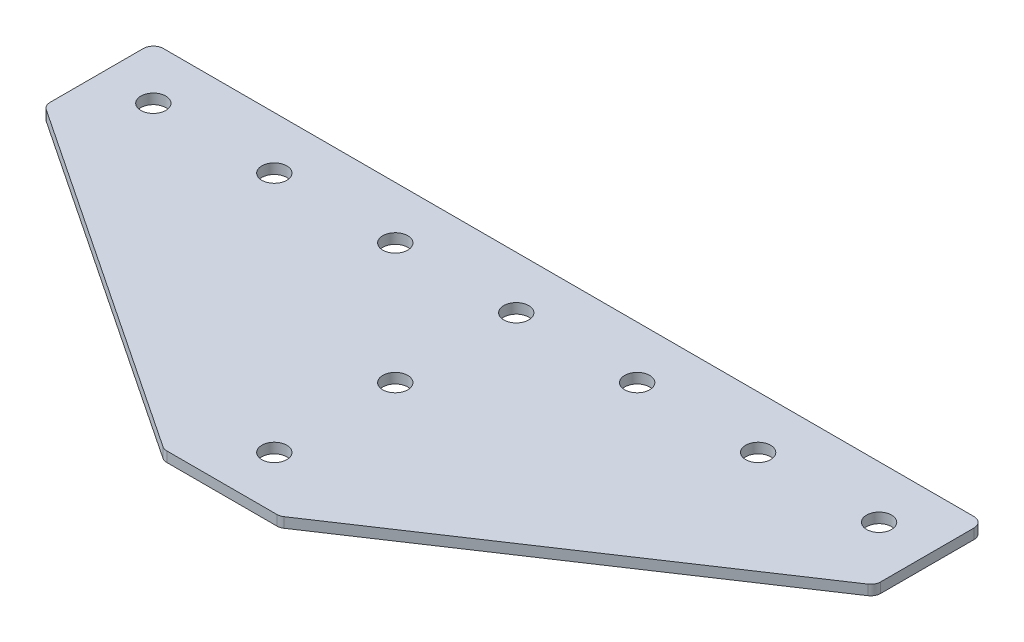
ISO-10303-21;
HEADER;
FILE_DESCRIPTION(('STEP AP214'),'2;1');
FILE_NAME('part.step','',(''),(''),'','','');
FILE_SCHEMA(('AUTOMOTIVE_DESIGN { 1 0 10303 214 1 1 1 1 }'));
ENDSEC;
DATA;
#1=APPLICATION_CONTEXT('core data for automotive mechanical design processes');
#2=APPLICATION_PROTOCOL_DEFINITION('international standard','automotive_design',2000,#1);
#3=PRODUCT_CONTEXT('',#1,'mechanical');
#4=PRODUCT('Part','Part','',(#3));
#5=PRODUCT_RELATED_PRODUCT_CATEGORY('part','',(#4));
#6=PRODUCT_DEFINITION_FORMATION('','',#4);
#7=PRODUCT_DEFINITION_CONTEXT('part definition',#1,'design');
#8=PRODUCT_DEFINITION('design','',#6,#7);
#9=PRODUCT_DEFINITION_SHAPE('','',#8);
#10=(LENGTH_UNIT() NAMED_UNIT(*) SI_UNIT(.MILLI.,.METRE.));
#11=(NAMED_UNIT(*) PLANE_ANGLE_UNIT() SI_UNIT($,.RADIAN.));
#12=(NAMED_UNIT(*) SI_UNIT($,.STERADIAN.) SOLID_ANGLE_UNIT());
#13=UNCERTAINTY_MEASURE_WITH_UNIT(LENGTH_MEASURE(1.E-05),#10,'distance_accuracy_value','');
#14=(GEOMETRIC_REPRESENTATION_CONTEXT(3) GLOBAL_UNCERTAINTY_ASSIGNED_CONTEXT((#13)) GLOBAL_UNIT_ASSIGNED_CONTEXT((#10,
#11,#12)) REPRESENTATION_CONTEXT('',''));
#15=CARTESIAN_POINT('',(0.,0.,0.));
#16=DIRECTION('',(0.,0.,1.));
#17=DIRECTION('',(1.,0.,0.));
#18=AXIS2_PLACEMENT_3D('',#15,#16,#17);
#19=CARTESIAN_POINT('',(-2.23293059684693,1.89126526075142,-30.907824161743));
#20=DIRECTION('',(0.,-1.,0.));
#21=DIRECTION('',(0.,0.,-1.));
#22=AXIS2_PLACEMENT_3D('',#19,#20,#21);
#23=PLANE('',#22);
#24=CARTESIAN_POINT('',(-2.23293059684693,1.89126526075142,-30.907824161743));
#25=DIRECTION('',(0.,1.,0.));
#26=DIRECTION('',(0.,0.,1.));
#27=AXIS2_PLACEMENT_3D('',#24,#25,#26);
#28=CIRCLE('',#27,3.1);
#29=CARTESIAN_POINT('',(-2.23293059684693,1.89126526075142,-27.807824161743));
#30=VERTEX_POINT('',#29);
#31=EDGE_CURVE('E119',#30,#30,#28,.T.);
#32=ORIENTED_EDGE('',*,*,#31,.T.);
#33=EDGE_LOOP('',(#32));
#34=FACE_BOUND('',#33,.T.);
#35=DIRECTION('',(1.,0.,0.));
#36=VECTOR('',#35,1.);
#37=CARTESIAN_POINT('',(-15.232930596847,1.89126526075142,42.0921758382569));
#38=LINE('',#37,#36);
#39=CARTESIAN_POINT('',(-15.870440227053,1.89126526075142,42.0921758382569));
#40=VERTEX_POINT('',#39);
#41=CARTESIAN_POINT('',(11.4045790333592,1.89126526075142,42.0921758382569));
#42=VERTEX_POINT('',#41);
#43=EDGE_CURVE('E176',#40,#42,#38,.T.);
#44=ORIENTED_EDGE('',*,*,#43,.F.);
#45=CARTESIAN_POINT('',(-15.870440227053,1.89126526075142,39.5921758382569));
#46=DIRECTION('',(0.,1.,0.));
#47=DIRECTION('',(0.,0.,-1.));
#48=AXIS2_PLACEMENT_3D('',#45,#46,#47);
#49=CIRCLE('',#48,2.5);
#50=CARTESIAN_POINT('',(-17.2571907176161,1.89126526075142,41.6723015741015));
#51=VERTEX_POINT('',#50);
#52=EDGE_CURVE('E233',#51,#40,#49,.T.);
#53=ORIENTED_EDGE('',*,*,#52,.F.);
#54=DIRECTION('',(-0.832050294337843,0.,-0.554700196225229));
#55=VECTOR('',#54,1.);
#56=CARTESIAN_POINT('',(-16.627379321383,1.89126526075142,42.0921758382569));
#57=LINE('',#56,#55);
#58=CARTESIAN_POINT('',(-104.11968108741,1.89126526075142,-16.2360253390943));
#59=VERTEX_POINT('',#58);
#60=EDGE_CURVE('E236',#51,#59,#57,.T.);
#61=ORIENTED_EDGE('',*,*,#60,.T.);
#62=CARTESIAN_POINT('',(-102.732930596847,1.89126526075142,-18.3161510749389));
#63=DIRECTION('',(0.,1.,0.));
#64=DIRECTION('',(0.,0.,-1.));
#65=AXIS2_PLACEMENT_3D('',#62,#63,#64);
#66=CIRCLE('',#65,2.5);
#67=CARTESIAN_POINT('',(-105.232930596847,1.89126526075142,-18.3161510749389));
#68=VERTEX_POINT('',#67);
#69=EDGE_CURVE('E239',#68,#59,#66,.T.);
#70=ORIENTED_EDGE('',*,*,#69,.F.);
#71=DIRECTION('',(0.,0.,-1.));
#72=VECTOR('',#71,1.);
#73=CARTESIAN_POINT('',(-105.232930596847,1.89126526075142,-16.978191678719));
#74=LINE('',#73,#72);
#75=CARTESIAN_POINT('',(-105.232930596847,1.89126526075142,-41.407824161743));
#76=VERTEX_POINT('',#75);
#77=EDGE_CURVE('E130',#68,#76,#74,.T.);
#78=ORIENTED_EDGE('',*,*,#77,.T.);
#79=CARTESIAN_POINT('',(-102.732930596847,1.89126526075142,-41.407824161743));
#80=DIRECTION('',(0.,1.,0.));
#81=DIRECTION('',(0.,0.,-1.));
#82=AXIS2_PLACEMENT_3D('',#79,#80,#81);
#83=CIRCLE('',#82,2.5);
#84=CARTESIAN_POINT('',(-102.732930596847,1.89126526075142,-43.907824161743));
#85=VERTEX_POINT('',#84);
#86=EDGE_CURVE('E245',#85,#76,#83,.T.);
#87=ORIENTED_EDGE('',*,*,#86,.F.);
#88=DIRECTION('',(-1.,0.,0.));
#89=VECTOR('',#88,1.);
#90=CARTESIAN_POINT('',(100.767069403153,1.89126526075142,-43.9078241617431));
#91=LINE('',#90,#89);
#92=CARTESIAN_POINT('',(98.267069403153,1.89126526075142,-43.9078241617431));
#93=VERTEX_POINT('',#92);
#94=EDGE_CURVE('E134',#93,#85,#91,.T.);
#95=ORIENTED_EDGE('',*,*,#94,.F.);
#96=CARTESIAN_POINT('',(98.267069403153,1.89126526075142,-41.4078241617431));
#97=DIRECTION('',(0.,-1.,0.));
#98=DIRECTION('',(0.,0.,-1.));
#99=AXIS2_PLACEMENT_3D('',#96,#97,#98);
#100=CIRCLE('',#99,2.5);
#101=CARTESIAN_POINT('',(100.767069403153,1.89126526075142,-41.4078241617431));
#102=VERTEX_POINT('',#101);
#103=EDGE_CURVE('E197',#93,#102,#100,.T.);
#104=ORIENTED_EDGE('',*,*,#103,.T.);
#105=DIRECTION('',(0.,0.,-1.));
#106=VECTOR('',#105,1.);
#107=CARTESIAN_POINT('',(100.767069403153,1.89126526075142,-16.978191678719));
#108=LINE('',#107,#106);
#109=CARTESIAN_POINT('',(100.767069403153,1.89126526075142,-18.316151074939));
#110=VERTEX_POINT('',#109);
#111=EDGE_CURVE('E181',#110,#102,#108,.T.);
#112=ORIENTED_EDGE('',*,*,#111,.F.);
#113=CARTESIAN_POINT('',(98.267069403153,1.89126526075142,-18.316151074939));
#114=DIRECTION('',(0.,-1.,0.));
#115=DIRECTION('',(0.,0.,-1.));
#116=AXIS2_PLACEMENT_3D('',#113,#114,#115);
#117=CIRCLE('',#116,2.5);
#118=CARTESIAN_POINT('',(99.653819893716,1.89126526075142,-16.2360253390943));
#119=VERTEX_POINT('',#118);
#120=EDGE_CURVE('E31',#110,#119,#117,.T.);
#121=ORIENTED_EDGE('',*,*,#120,.T.);
#122=DIRECTION('',(0.832050294337843,0.,-0.554700196225229));
#123=VECTOR('',#122,1.);
#124=CARTESIAN_POINT('',(12.1615181276892,1.89126526075142,42.0921758382569));
#125=LINE('',#124,#123);
#126=CARTESIAN_POINT('',(12.7913295239223,1.89126526075142,41.6723015741015));
#127=VERTEX_POINT('',#126);
#128=EDGE_CURVE('E179',#127,#119,#125,.T.);
#129=ORIENTED_EDGE('',*,*,#128,.F.);
#130=CARTESIAN_POINT('',(11.4045790333592,1.89126526075142,39.5921758382569));
#131=DIRECTION('',(0.,-1.,0.));
#132=DIRECTION('',(0.,0.,-1.));
#133=AXIS2_PLACEMENT_3D('',#130,#131,#132);
#134=CIRCLE('',#133,2.5);
#135=EDGE_CURVE('E200',#127,#42,#134,.T.);
#136=ORIENTED_EDGE('',*,*,#135,.T.);
#137=EDGE_LOOP('',(#44,#53,#61,#70,#78,#87,#95,#104,#112,#121,#129,#136));
#138=FACE_BOUND('',#137,.T.);
#139=CARTESIAN_POINT('',(-2.23293059684694,1.89126526075142,29.092175838257));
#140=DIRECTION('',(0.,1.,0.));
#141=DIRECTION('',(0.,0.,1.));
#142=AXIS2_PLACEMENT_3D('',#139,#140,#141);
#143=CIRCLE('',#142,3.1);
#144=CARTESIAN_POINT('',(-2.23293059684694,1.89126526075142,32.192175838257));
#145=VERTEX_POINT('',#144);
#146=EDGE_CURVE('E153',#145,#145,#143,.T.);
#147=ORIENTED_EDGE('',*,*,#146,.T.);
#148=EDGE_LOOP('',(#147));
#149=FACE_BOUND('',#148,.T.);
#150=CARTESIAN_POINT('',(-2.23293059684694,1.89126526075142,-0.90782416174302));
#151=DIRECTION('',(0.,1.,0.));
#152=DIRECTION('',(0.,0.,1.));
#153=AXIS2_PLACEMENT_3D('',#150,#151,#152);
#154=CIRCLE('',#153,3.1);
#155=CARTESIAN_POINT('',(-2.23293059684694,1.89126526075142,2.19217583825698));
#156=VERTEX_POINT('',#155);
#157=EDGE_CURVE('E159',#156,#156,#154,.T.);
#158=ORIENTED_EDGE('',*,*,#157,.T.);
#159=EDGE_LOOP('',(#158));
#160=FACE_BOUND('',#159,.T.);
#161=CARTESIAN_POINT('',(87.7670694031531,1.89126526075142,-30.907824161743));
#162=DIRECTION('',(0.,1.,0.));
#163=DIRECTION('',(0.,0.,1.));
#164=AXIS2_PLACEMENT_3D('',#161,#162,#163);
#165=CIRCLE('',#164,3.1);
#166=CARTESIAN_POINT('',(87.7670694031531,1.89126526075142,-27.807824161743));
#167=VERTEX_POINT('',#166);
#168=EDGE_CURVE('E139',#167,#167,#165,.T.);
#169=ORIENTED_EDGE('',*,*,#168,.T.);
#170=EDGE_LOOP('',(#169));
#171=FACE_BOUND('',#170,.T.);
#172=CARTESIAN_POINT('',(57.7670694031531,1.89126526075142,-30.907824161743));
#173=DIRECTION('',(0.,1.,0.));
#174=DIRECTION('',(0.,0.,1.));
#175=AXIS2_PLACEMENT_3D('',#172,#173,#174);
#176=CIRCLE('',#175,3.1);
#177=CARTESIAN_POINT('',(57.7670694031531,1.89126526075142,-27.807824161743));
#178=VERTEX_POINT('',#177);
#179=EDGE_CURVE('E147',#178,#178,#176,.T.);
#180=ORIENTED_EDGE('',*,*,#179,.T.);
#181=EDGE_LOOP('',(#180));
#182=FACE_BOUND('',#181,.T.);
#183=CARTESIAN_POINT('',(27.7670694031531,1.89126526075142,-30.907824161743));
#184=DIRECTION('',(0.,1.,0.));
#185=DIRECTION('',(0.,0.,1.));
#186=AXIS2_PLACEMENT_3D('',#183,#184,#185);
#187=CIRCLE('',#186,3.1);
#188=CARTESIAN_POINT('',(27.7670694031531,1.89126526075142,-27.807824161743));
#189=VERTEX_POINT('',#188);
#190=EDGE_CURVE('E165',#189,#189,#187,.T.);
#191=ORIENTED_EDGE('',*,*,#190,.T.);
#192=EDGE_LOOP('',(#191));
#193=FACE_BOUND('',#192,.T.);
#194=CARTESIAN_POINT('',(-92.2329305968469,1.89126526075142,-30.907824161743));
#195=DIRECTION('',(0.,-1.,0.));
#196=DIRECTION('',(0.,0.,1.));
#197=AXIS2_PLACEMENT_3D('',#194,#195,#196);
#198=CIRCLE('',#197,3.1);
#199=CARTESIAN_POINT('',(-92.2329305968469,1.89126526075142,-27.807824161743));
#200=VERTEX_POINT('',#199);
#201=EDGE_CURVE('E465',#200,#200,#198,.T.);
#202=ORIENTED_EDGE('',*,*,#201,.F.);
#203=EDGE_LOOP('',(#202));
#204=FACE_BOUND('',#203,.T.);
#205=CARTESIAN_POINT('',(-62.2329305968469,1.89126526075142,-30.907824161743));
#206=DIRECTION('',(0.,-1.,0.));
#207=DIRECTION('',(0.,0.,1.));
#208=AXIS2_PLACEMENT_3D('',#205,#206,#207);
#209=CIRCLE('',#208,3.1);
#210=CARTESIAN_POINT('',(-62.2329305968469,1.89126526075142,-27.807824161743));
#211=VERTEX_POINT('',#210);
#212=EDGE_CURVE('E474',#211,#211,#209,.T.);
#213=ORIENTED_EDGE('',*,*,#212,.F.);
#214=EDGE_LOOP('',(#213));
#215=FACE_BOUND('',#214,.T.);
#216=CARTESIAN_POINT('',(-32.2329305968469,1.89126526075142,-30.907824161743));
#217=DIRECTION('',(0.,-1.,0.));
#218=DIRECTION('',(0.,0.,1.));
#219=AXIS2_PLACEMENT_3D('',#216,#217,#218);
#220=CIRCLE('',#219,3.1);
#221=CARTESIAN_POINT('',(-32.2329305968469,1.89126526075142,-27.807824161743));
#222=VERTEX_POINT('',#221);
#223=EDGE_CURVE('E266',#222,#222,#220,.T.);
#224=ORIENTED_EDGE('',*,*,#223,.F.);
#225=EDGE_LOOP('',(#224));
#226=FACE_BOUND('',#225,.T.);
#227=ADVANCED_FACE('F16',(#34,#138,#149,#160,#171,#182,#193,#204,#215,#226),#23,.T.);
#228=CARTESIAN_POINT('',(100.767069403153,1.89126526075142,-43.9078241617431));
#229=DIRECTION('',(0.,0.,-1.));
#230=DIRECTION('',(-1.,0.,0.));
#231=AXIS2_PLACEMENT_3D('',#228,#229,#230);
#232=PLANE('',#231);
#233=ORIENTED_EDGE('',*,*,#94,.T.);
#234=DIRECTION('',(0.,1.,0.));
#235=VECTOR('',#234,1.);
#236=CARTESIAN_POINT('',(-102.732930596847,1.89126526075142,-43.907824161743));
#237=LINE('',#236,#235);
#238=CARTESIAN_POINT('',(-102.732930596847,4.39126526075142,-43.907824161743));
#239=VERTEX_POINT('',#238);
#240=EDGE_CURVE('E125',#239,#85,#237,.F.);
#241=ORIENTED_EDGE('',*,*,#240,.F.);
#242=DIRECTION('',(-1.,0.,0.));
#243=VECTOR('',#242,1.);
#244=CARTESIAN_POINT('',(100.767069403153,4.39126526075142,-43.9078241617431));
#245=LINE('',#244,#243);
#246=CARTESIAN_POINT('',(98.267069403153,4.39126526075142,-43.9078241617431));
#247=VERTEX_POINT('',#246);
#248=EDGE_CURVE('E105',#247,#239,#245,.T.);
#249=ORIENTED_EDGE('',*,*,#248,.F.);
#250=DIRECTION('',(0.,1.,0.));
#251=VECTOR('',#250,1.);
#252=CARTESIAN_POINT('',(98.267069403153,1.89126526075142,-43.9078241617431));
#253=LINE('',#252,#251);
#254=EDGE_CURVE('E10',#247,#93,#253,.F.);
#255=ORIENTED_EDGE('',*,*,#254,.T.);
#256=EDGE_LOOP('',(#233,#241,#249,#255));
#257=FACE_BOUND('',#256,.T.);
#258=ADVANCED_FACE('F132',(#257),#232,.T.);
#259=CARTESIAN_POINT('',(100.767069403153,1.89126526075142,-16.978191678719));
#260=DIRECTION('',(1.,0.,0.));
#261=DIRECTION('',(0.,0.,-1.));
#262=AXIS2_PLACEMENT_3D('',#259,#260,#261);
#263=PLANE('',#262);
#264=DIRECTION('',(0.,0.,-1.));
#265=VECTOR('',#264,1.);
#266=CARTESIAN_POINT('',(100.767069403153,4.39126526075142,-16.978191678719));
#267=LINE('',#266,#265);
#268=CARTESIAN_POINT('',(100.767069403153,4.39126526075142,-18.316151074939));
#269=VERTEX_POINT('',#268);
#270=CARTESIAN_POINT('',(100.767069403153,4.39126526075142,-41.4078241617431));
#271=VERTEX_POINT('',#270);
#272=EDGE_CURVE('E177',#269,#271,#267,.T.);
#273=ORIENTED_EDGE('',*,*,#272,.F.);
#274=DIRECTION('',(0.,1.,0.));
#275=VECTOR('',#274,1.);
#276=CARTESIAN_POINT('',(100.767069403153,1.89126526075142,-18.316151074939));
#277=LINE('',#276,#275);
#278=EDGE_CURVE('E24',#269,#110,#277,.F.);
#279=ORIENTED_EDGE('',*,*,#278,.T.);
#280=ORIENTED_EDGE('',*,*,#111,.T.);
#281=DIRECTION('',(0.,1.,0.));
#282=VECTOR('',#281,1.);
#283=CARTESIAN_POINT('',(100.767069403153,1.89126526075142,-41.4078241617431));
#284=LINE('',#283,#282);
#285=EDGE_CURVE('E207',#102,#271,#284,.T.);
#286=ORIENTED_EDGE('',*,*,#285,.T.);
#287=EDGE_LOOP('',(#273,#279,#280,#286));
#288=FACE_BOUND('',#287,.T.);
#289=ADVANCED_FACE('F212',(#288),#263,.T.);
#290=CARTESIAN_POINT('',(12.1615181276892,1.89126526075142,42.0921758382569));
#291=DIRECTION('',(0.554700196225229,0.,0.832050294337843));
#292=DIRECTION('',(0.832050294337843,0.,-0.554700196225229));
#293=AXIS2_PLACEMENT_3D('',#290,#291,#292);
#294=PLANE('',#293);
#295=DIRECTION('',(0.832050294337843,0.,-0.554700196225229));
#296=VECTOR('',#295,1.);
#297=CARTESIAN_POINT('',(12.1615181276892,4.39126526075142,42.0921758382569));
#298=LINE('',#297,#296);
#299=CARTESIAN_POINT('',(12.7913295239223,4.39126526075142,41.6723015741015));
#300=VERTEX_POINT('',#299);
#301=CARTESIAN_POINT('',(99.653819893716,4.39126526075142,-16.2360253390943));
#302=VERTEX_POINT('',#301);
#303=EDGE_CURVE('E185',#300,#302,#298,.T.);
#304=ORIENTED_EDGE('',*,*,#303,.F.);
#305=DIRECTION('',(0.,1.,0.));
#306=VECTOR('',#305,1.);
#307=CARTESIAN_POINT('',(12.7913295239223,1.89126526075142,41.6723015741015));
#308=LINE('',#307,#306);
#309=EDGE_CURVE('E38',#300,#127,#308,.F.);
#310=ORIENTED_EDGE('',*,*,#309,.T.);
#311=ORIENTED_EDGE('',*,*,#128,.T.);
#312=DIRECTION('',(0.,1.,0.));
#313=VECTOR('',#312,1.);
#314=CARTESIAN_POINT('',(99.653819893716,1.89126526075142,-16.2360253390943));
#315=LINE('',#314,#313);
#316=EDGE_CURVE('E203',#119,#302,#315,.T.);
#317=ORIENTED_EDGE('',*,*,#316,.T.);
#318=EDGE_LOOP('',(#304,#310,#311,#317));
#319=FACE_BOUND('',#318,.T.);
#320=ADVANCED_FACE('F219',(#319),#294,.T.);
#321=CARTESIAN_POINT('',(-15.232930596847,1.89126526075142,42.0921758382569));
#322=DIRECTION('',(0.,0.,1.));
#323=DIRECTION('',(1.,0.,0.));
#324=AXIS2_PLACEMENT_3D('',#321,#322,#323);
#325=PLANE('',#324);
#326=DIRECTION('',(1.,0.,0.));
#327=VECTOR('',#326,1.);
#328=CARTESIAN_POINT('',(-15.232930596847,4.39126526075142,42.0921758382569));
#329=LINE('',#328,#327);
#330=CARTESIAN_POINT('',(-15.870440227053,4.39126526075142,42.0921758382569));
#331=VERTEX_POINT('',#330);
#332=CARTESIAN_POINT('',(11.4045790333592,4.39126526075142,42.0921758382569));
#333=VERTEX_POINT('',#332);
#334=EDGE_CURVE('E118',#331,#333,#329,.T.);
#335=ORIENTED_EDGE('',*,*,#334,.F.);
#336=DIRECTION('',(0.,1.,0.));
#337=VECTOR('',#336,1.);
#338=CARTESIAN_POINT('',(-15.870440227053,1.89126526075142,42.0921758382569));
#339=LINE('',#338,#337);
#340=EDGE_CURVE('E229',#40,#331,#339,.T.);
#341=ORIENTED_EDGE('',*,*,#340,.F.);
#342=ORIENTED_EDGE('',*,*,#43,.T.);
#343=DIRECTION('',(0.,1.,0.));
#344=VECTOR('',#343,1.);
#345=CARTESIAN_POINT('',(11.4045790333592,1.89126526075142,42.0921758382569));
#346=LINE('',#345,#344);
#347=EDGE_CURVE('E194',#42,#333,#346,.T.);
#348=ORIENTED_EDGE('',*,*,#347,.T.);
#349=EDGE_LOOP('',(#335,#341,#342,#348));
#350=FACE_BOUND('',#349,.T.);
#351=ADVANCED_FACE('F226',(#350),#325,.T.);
#352=CARTESIAN_POINT('',(-2.23293059684693,4.39126526075142,-30.907824161743));
#353=DIRECTION('',(0.,-1.,0.));
#354=DIRECTION('',(0.,0.,-1.));
#355=AXIS2_PLACEMENT_3D('',#352,#353,#354);
#356=PLANE('',#355);
#357=CARTESIAN_POINT('',(-2.23293059684693,4.39126526075142,-30.907824161743));
#358=DIRECTION('',(0.,1.,0.));
#359=DIRECTION('',(0.,0.,1.));
#360=AXIS2_PLACEMENT_3D('',#357,#358,#359);
#361=CIRCLE('',#360,3.1);
#362=CARTESIAN_POINT('',(-2.23293059684693,4.39126526075142,-27.807824161743));
#363=VERTEX_POINT('',#362);
#364=EDGE_CURVE('E168',#363,#363,#361,.T.);
#365=ORIENTED_EDGE('',*,*,#364,.F.);
#366=EDGE_LOOP('',(#365));
#367=FACE_BOUND('',#366,.T.);
#368=CARTESIAN_POINT('',(-15.870440227053,4.39126526075142,39.5921758382569));
#369=DIRECTION('',(0.,1.,0.));
#370=DIRECTION('',(0.,0.,-1.));
#371=AXIS2_PLACEMENT_3D('',#368,#369,#370);
#372=CIRCLE('',#371,2.5);
#373=CARTESIAN_POINT('',(-17.2571907176161,4.39126526075142,41.6723015741015));
#374=VERTEX_POINT('',#373);
#375=EDGE_CURVE('E251',#331,#374,#372,.F.);
#376=ORIENTED_EDGE('',*,*,#375,.F.);
#377=ORIENTED_EDGE('',*,*,#334,.T.);
#378=CARTESIAN_POINT('',(11.4045790333592,4.39126526075142,39.5921758382569));
#379=DIRECTION('',(0.,-1.,0.));
#380=DIRECTION('',(0.,0.,-1.));
#381=AXIS2_PLACEMENT_3D('',#378,#379,#380);
#382=CIRCLE('',#381,2.5);
#383=EDGE_CURVE('E192',#333,#300,#382,.F.);
#384=ORIENTED_EDGE('',*,*,#383,.T.);
#385=ORIENTED_EDGE('',*,*,#303,.T.);
#386=CARTESIAN_POINT('',(98.267069403153,4.39126526075142,-18.316151074939));
#387=DIRECTION('',(0.,-1.,0.));
#388=DIRECTION('',(0.,0.,-1.));
#389=AXIS2_PLACEMENT_3D('',#386,#387,#388);
#390=CIRCLE('',#389,2.5);
#391=EDGE_CURVE('E190',#302,#269,#390,.F.);
#392=ORIENTED_EDGE('',*,*,#391,.T.);
#393=ORIENTED_EDGE('',*,*,#272,.T.);
#394=CARTESIAN_POINT('',(98.267069403153,4.39126526075142,-41.4078241617431));
#395=DIRECTION('',(0.,-1.,0.));
#396=DIRECTION('',(0.,0.,-1.));
#397=AXIS2_PLACEMENT_3D('',#394,#395,#396);
#398=CIRCLE('',#397,2.5);
#399=EDGE_CURVE('E114',#271,#247,#398,.F.);
#400=ORIENTED_EDGE('',*,*,#399,.T.);
#401=ORIENTED_EDGE('',*,*,#248,.T.);
#402=CARTESIAN_POINT('',(-102.732930596847,4.39126526075142,-41.407824161743));
#403=DIRECTION('',(0.,1.,0.));
#404=DIRECTION('',(0.,0.,-1.));
#405=AXIS2_PLACEMENT_3D('',#402,#403,#404);
#406=CIRCLE('',#405,2.5);
#407=CARTESIAN_POINT('',(-105.232930596847,4.39126526075142,-41.407824161743));
#408=VERTEX_POINT('',#407);
#409=EDGE_CURVE('E111',#408,#239,#406,.F.);
#410=ORIENTED_EDGE('',*,*,#409,.F.);
#411=DIRECTION('',(0.,0.,-1.));
#412=VECTOR('',#411,1.);
#413=CARTESIAN_POINT('',(-105.232930596847,4.39126526075142,-16.978191678719));
#414=LINE('',#413,#412);
#415=CARTESIAN_POINT('',(-105.232930596847,4.39126526075142,-18.3161510749389));
#416=VERTEX_POINT('',#415);
#417=EDGE_CURVE('E256',#416,#408,#414,.T.);
#418=ORIENTED_EDGE('',*,*,#417,.F.);
#419=CARTESIAN_POINT('',(-102.732930596847,4.39126526075142,-18.3161510749389));
#420=DIRECTION('',(0.,1.,0.));
#421=DIRECTION('',(0.,0.,-1.));
#422=AXIS2_PLACEMENT_3D('',#419,#420,#421);
#423=CIRCLE('',#422,2.5);
#424=CARTESIAN_POINT('',(-104.11968108741,4.39126526075142,-16.2360253390943));
#425=VERTEX_POINT('',#424);
#426=EDGE_CURVE('E129',#425,#416,#423,.F.);
#427=ORIENTED_EDGE('',*,*,#426,.F.);
#428=DIRECTION('',(-0.832050294337843,0.,-0.554700196225229));
#429=VECTOR('',#428,1.);
#430=CARTESIAN_POINT('',(-16.627379321383,4.39126526075142,42.0921758382569));
#431=LINE('',#430,#429);
#432=EDGE_CURVE('E260',#374,#425,#431,.T.);
#433=ORIENTED_EDGE('',*,*,#432,.F.);
#434=EDGE_LOOP('',(#376,#377,#384,#385,#392,#393,#400,#401,#410,#418,#427,#433));
#435=FACE_BOUND('',#434,.T.);
#436=CARTESIAN_POINT('',(-2.23293059684694,4.39126526075142,29.092175838257));
#437=DIRECTION('',(0.,1.,0.));
#438=DIRECTION('',(0.,0.,1.));
#439=AXIS2_PLACEMENT_3D('',#436,#437,#438);
#440=CIRCLE('',#439,3.1);
#441=CARTESIAN_POINT('',(-2.23293059684694,4.39126526075142,32.192175838257));
#442=VERTEX_POINT('',#441);
#443=EDGE_CURVE('E150',#442,#442,#440,.T.);
#444=ORIENTED_EDGE('',*,*,#443,.F.);
#445=EDGE_LOOP('',(#444));
#446=FACE_BOUND('',#445,.T.);
#447=CARTESIAN_POINT('',(87.7670694031531,4.39126526075142,-30.907824161743));
#448=DIRECTION('',(0.,1.,0.));
#449=DIRECTION('',(0.,0.,1.));
#450=AXIS2_PLACEMENT_3D('',#447,#448,#449);
#451=CIRCLE('',#450,3.1);
#452=CARTESIAN_POINT('',(87.7670694031531,4.39126526075142,-27.807824161743));
#453=VERTEX_POINT('',#452);
#454=EDGE_CURVE('E135',#453,#453,#451,.T.);
#455=ORIENTED_EDGE('',*,*,#454,.F.);
#456=EDGE_LOOP('',(#455));
#457=FACE_BOUND('',#456,.T.);
#458=CARTESIAN_POINT('',(57.7670694031531,4.39126526075142,-30.907824161743));
#459=DIRECTION('',(0.,1.,0.));
#460=DIRECTION('',(0.,0.,1.));
#461=AXIS2_PLACEMENT_3D('',#458,#459,#460);
#462=CIRCLE('',#461,3.1);
#463=CARTESIAN_POINT('',(57.7670694031531,4.39126526075142,-27.807824161743));
#464=VERTEX_POINT('',#463);
#465=EDGE_CURVE('E145',#464,#464,#462,.T.);
#466=ORIENTED_EDGE('',*,*,#465,.F.);
#467=EDGE_LOOP('',(#466));
#468=FACE_BOUND('',#467,.T.);
#469=CARTESIAN_POINT('',(27.7670694031531,4.39126526075142,-30.907824161743));
#470=DIRECTION('',(0.,1.,0.));
#471=DIRECTION('',(0.,0.,1.));
#472=AXIS2_PLACEMENT_3D('',#469,#470,#471);
#473=CIRCLE('',#472,3.1);
#474=CARTESIAN_POINT('',(27.7670694031531,4.39126526075142,-27.807824161743));
#475=VERTEX_POINT('',#474);
#476=EDGE_CURVE('E162',#475,#475,#473,.T.);
#477=ORIENTED_EDGE('',*,*,#476,.F.);
#478=EDGE_LOOP('',(#477));
#479=FACE_BOUND('',#478,.T.);
#480=CARTESIAN_POINT('',(-2.23293059684694,4.39126526075142,-0.90782416174302));
#481=DIRECTION('',(0.,1.,0.));
#482=DIRECTION('',(0.,0.,1.));
#483=AXIS2_PLACEMENT_3D('',#480,#481,#482);
#484=CIRCLE('',#483,3.1);
#485=CARTESIAN_POINT('',(-2.23293059684694,4.39126526075142,2.19217583825698));
#486=VERTEX_POINT('',#485);
#487=EDGE_CURVE('E156',#486,#486,#484,.T.);
#488=ORIENTED_EDGE('',*,*,#487,.F.);
#489=EDGE_LOOP('',(#488));
#490=FACE_BOUND('',#489,.T.);
#491=CARTESIAN_POINT('',(-92.2329305968469,4.39126526075142,-30.907824161743));
#492=DIRECTION('',(0.,-1.,0.));
#493=DIRECTION('',(0.,0.,1.));
#494=AXIS2_PLACEMENT_3D('',#491,#492,#493);
#495=CIRCLE('',#494,3.1);
#496=CARTESIAN_POINT('',(-92.2329305968469,4.39126526075142,-27.807824161743));
#497=VERTEX_POINT('',#496);
#498=EDGE_CURVE('E468',#497,#497,#495,.T.);
#499=ORIENTED_EDGE('',*,*,#498,.T.);
#500=EDGE_LOOP('',(#499));
#501=FACE_BOUND('',#500,.T.);
#502=CARTESIAN_POINT('',(-62.2329305968469,4.39126526075142,-30.907824161743));
#503=DIRECTION('',(0.,-1.,0.));
#504=DIRECTION('',(0.,0.,1.));
#505=AXIS2_PLACEMENT_3D('',#502,#503,#504);
#506=CIRCLE('',#505,3.1);
#507=CARTESIAN_POINT('',(-62.2329305968469,4.39126526075142,-27.807824161743));
#508=VERTEX_POINT('',#507);
#509=EDGE_CURVE('E471',#508,#508,#506,.T.);
#510=ORIENTED_EDGE('',*,*,#509,.T.);
#511=EDGE_LOOP('',(#510));
#512=FACE_BOUND('',#511,.T.);
#513=CARTESIAN_POINT('',(-32.2329305968469,4.39126526075142,-30.907824161743));
#514=DIRECTION('',(0.,-1.,0.));
#515=DIRECTION('',(0.,0.,1.));
#516=AXIS2_PLACEMENT_3D('',#513,#514,#515);
#517=CIRCLE('',#516,3.1);
#518=CARTESIAN_POINT('',(-32.2329305968469,4.39126526075142,-27.807824161743));
#519=VERTEX_POINT('',#518);
#520=EDGE_CURVE('E263',#519,#519,#517,.T.);
#521=ORIENTED_EDGE('',*,*,#520,.T.);
#522=EDGE_LOOP('',(#521));
#523=FACE_BOUND('',#522,.T.);
#524=ADVANCED_FACE('F108',(#367,#435,#446,#457,#468,#479,#490,#501,#512,#523),#356,.F.);
#525=CARTESIAN_POINT('',(11.4045790333592,1.89126526075142,39.5921758382569));
#526=DIRECTION('',(0.,1.,0.));
#527=DIRECTION('',(0.,0.,1.));
#528=AXIS2_PLACEMENT_3D('',#525,#526,#527);
#529=CYLINDRICAL_SURFACE('',#528,2.5);
#530=ORIENTED_EDGE('',*,*,#135,.F.);
#531=ORIENTED_EDGE('',*,*,#309,.F.);
#532=ORIENTED_EDGE('',*,*,#383,.F.);
#533=ORIENTED_EDGE('',*,*,#347,.F.);
#534=EDGE_LOOP('',(#530,#531,#532,#533));
#535=FACE_BOUND('',#534,.T.);
#536=ADVANCED_FACE('F224',(#535),#529,.T.);
#537=CARTESIAN_POINT('',(98.267069403153,1.89126526075142,-18.316151074939));
#538=DIRECTION('',(0.,1.,0.));
#539=DIRECTION('',(0.,0.,1.));
#540=AXIS2_PLACEMENT_3D('',#537,#538,#539);
#541=CYLINDRICAL_SURFACE('',#540,2.5);
#542=ORIENTED_EDGE('',*,*,#120,.F.);
#543=ORIENTED_EDGE('',*,*,#278,.F.);
#544=ORIENTED_EDGE('',*,*,#391,.F.);
#545=ORIENTED_EDGE('',*,*,#316,.F.);
#546=EDGE_LOOP('',(#542,#543,#544,#545));
#547=FACE_BOUND('',#546,.T.);
#548=ADVANCED_FACE('F218',(#547),#541,.T.);
#549=CARTESIAN_POINT('',(98.267069403153,1.89126526075142,-41.4078241617431));
#550=DIRECTION('',(0.,1.,0.));
#551=DIRECTION('',(0.,0.,1.));
#552=AXIS2_PLACEMENT_3D('',#549,#550,#551);
#553=CYLINDRICAL_SURFACE('',#552,2.5);
#554=ORIENTED_EDGE('',*,*,#103,.F.);
#555=ORIENTED_EDGE('',*,*,#254,.F.);
#556=ORIENTED_EDGE('',*,*,#399,.F.);
#557=ORIENTED_EDGE('',*,*,#285,.F.);
#558=EDGE_LOOP('',(#554,#555,#556,#557));
#559=FACE_BOUND('',#558,.T.);
#560=ADVANCED_FACE('F18',(#559),#553,.T.);
#561=CARTESIAN_POINT('',(-2.23293059684693,1.89126526075142,-30.907824161743));
#562=DIRECTION('',(0.,1.,0.));
#563=DIRECTION('',(0.,0.,1.));
#564=AXIS2_PLACEMENT_3D('',#561,#562,#563);
#565=CYLINDRICAL_SURFACE('',#564,3.1);
#566=ORIENTED_EDGE('',*,*,#31,.F.);
#567=EDGE_LOOP('',(#566));
#568=FACE_BOUND('',#567,.T.);
#569=ORIENTED_EDGE('',*,*,#364,.T.);
#570=EDGE_LOOP('',(#569));
#571=FACE_BOUND('',#570,.T.);
#572=ADVANCED_FACE('F300',(#568,#571),#565,.F.);
#573=CARTESIAN_POINT('',(27.7670694031531,1.89126526075142,-30.907824161743));
#574=DIRECTION('',(0.,1.,0.));
#575=DIRECTION('',(0.,0.,1.));
#576=AXIS2_PLACEMENT_3D('',#573,#574,#575);
#577=CYLINDRICAL_SURFACE('',#576,3.1);
#578=ORIENTED_EDGE('',*,*,#190,.F.);
#579=EDGE_LOOP('',(#578));
#580=FACE_BOUND('',#579,.T.);
#581=ORIENTED_EDGE('',*,*,#476,.T.);
#582=EDGE_LOOP('',(#581));
#583=FACE_BOUND('',#582,.T.);
#584=ADVANCED_FACE('F305',(#580,#583),#577,.F.);
#585=CARTESIAN_POINT('',(-2.23293059684694,1.89126526075142,-0.90782416174302));
#586=DIRECTION('',(0.,1.,0.));
#587=DIRECTION('',(0.,0.,1.));
#588=AXIS2_PLACEMENT_3D('',#585,#586,#587);
#589=CYLINDRICAL_SURFACE('',#588,3.1);
#590=ORIENTED_EDGE('',*,*,#487,.T.);
#591=EDGE_LOOP('',(#590));
#592=FACE_BOUND('',#591,.T.);
#593=ORIENTED_EDGE('',*,*,#157,.F.);
#594=EDGE_LOOP('',(#593));
#595=FACE_BOUND('',#594,.T.);
#596=ADVANCED_FACE('F311',(#592,#595),#589,.F.);
#597=CARTESIAN_POINT('',(-2.23293059684694,1.89126526075142,29.092175838257));
#598=DIRECTION('',(0.,1.,0.));
#599=DIRECTION('',(0.,0.,1.));
#600=AXIS2_PLACEMENT_3D('',#597,#598,#599);
#601=CYLINDRICAL_SURFACE('',#600,3.1);
#602=ORIENTED_EDGE('',*,*,#443,.T.);
#603=EDGE_LOOP('',(#602));
#604=FACE_BOUND('',#603,.T.);
#605=ORIENTED_EDGE('',*,*,#146,.F.);
#606=EDGE_LOOP('',(#605));
#607=FACE_BOUND('',#606,.T.);
#608=ADVANCED_FACE('F366',(#604,#607),#601,.F.);
#609=CARTESIAN_POINT('',(57.7670694031531,1.89126526075142,-30.907824161743));
#610=DIRECTION('',(0.,1.,0.));
#611=DIRECTION('',(0.,0.,1.));
#612=AXIS2_PLACEMENT_3D('',#609,#610,#611);
#613=CYLINDRICAL_SURFACE('',#612,3.1);
#614=ORIENTED_EDGE('',*,*,#179,.F.);
#615=EDGE_LOOP('',(#614));
#616=FACE_BOUND('',#615,.T.);
#617=ORIENTED_EDGE('',*,*,#465,.T.);
#618=EDGE_LOOP('',(#617));
#619=FACE_BOUND('',#618,.T.);
#620=ADVANCED_FACE('F375',(#616,#619),#613,.F.);
#621=CARTESIAN_POINT('',(87.7670694031531,1.89126526075142,-30.907824161743));
#622=DIRECTION('',(0.,1.,0.));
#623=DIRECTION('',(0.,0.,1.));
#624=AXIS2_PLACEMENT_3D('',#621,#622,#623);
#625=CYLINDRICAL_SURFACE('',#624,3.1);
#626=ORIENTED_EDGE('',*,*,#168,.F.);
#627=EDGE_LOOP('',(#626));
#628=FACE_BOUND('',#627,.T.);
#629=ORIENTED_EDGE('',*,*,#454,.T.);
#630=EDGE_LOOP('',(#629));
#631=FACE_BOUND('',#630,.T.);
#632=ADVANCED_FACE('F385',(#628,#631),#625,.F.);
#633=CARTESIAN_POINT('',(-105.232930596847,1.89126526075142,-16.978191678719));
#634=DIRECTION('',(-1.,0.,0.));
#635=DIRECTION('',(0.,0.,-1.));
#636=AXIS2_PLACEMENT_3D('',#633,#634,#635);
#637=PLANE('',#636);
#638=ORIENTED_EDGE('',*,*,#417,.T.);
#639=DIRECTION('',(0.,1.,0.));
#640=VECTOR('',#639,1.);
#641=CARTESIAN_POINT('',(-105.232930596847,1.89126526075142,-41.407824161743));
#642=LINE('',#641,#640);
#643=EDGE_CURVE('E127',#76,#408,#642,.T.);
#644=ORIENTED_EDGE('',*,*,#643,.F.);
#645=ORIENTED_EDGE('',*,*,#77,.F.);
#646=DIRECTION('',(0.,1.,0.));
#647=VECTOR('',#646,1.);
#648=CARTESIAN_POINT('',(-105.232930596847,1.89126526075142,-18.3161510749389));
#649=LINE('',#648,#647);
#650=EDGE_CURVE('E136',#416,#68,#649,.F.);
#651=ORIENTED_EDGE('',*,*,#650,.F.);
#652=EDGE_LOOP('',(#638,#644,#645,#651));
#653=FACE_BOUND('',#652,.T.);
#654=ADVANCED_FACE('F273',(#653),#637,.T.);
#655=CARTESIAN_POINT('',(-16.627379321383,1.89126526075142,42.0921758382569));
#656=DIRECTION('',(-0.554700196225229,0.,0.832050294337844));
#657=DIRECTION('',(-0.832050294337844,0.,-0.554700196225229));
#658=AXIS2_PLACEMENT_3D('',#655,#656,#657);
#659=PLANE('',#658);
#660=ORIENTED_EDGE('',*,*,#432,.T.);
#661=DIRECTION('',(0.,1.,0.));
#662=VECTOR('',#661,1.);
#663=CARTESIAN_POINT('',(-104.11968108741,1.89126526075142,-16.2360253390943));
#664=LINE('',#663,#662);
#665=EDGE_CURVE('E238',#59,#425,#664,.T.);
#666=ORIENTED_EDGE('',*,*,#665,.F.);
#667=ORIENTED_EDGE('',*,*,#60,.F.);
#668=DIRECTION('',(0.,1.,0.));
#669=VECTOR('',#668,1.);
#670=CARTESIAN_POINT('',(-17.2571907176161,1.89126526075142,41.6723015741015));
#671=LINE('',#670,#669);
#672=EDGE_CURVE('E242',#374,#51,#671,.F.);
#673=ORIENTED_EDGE('',*,*,#672,.F.);
#674=EDGE_LOOP('',(#660,#666,#667,#673));
#675=FACE_BOUND('',#674,.T.);
#676=ADVANCED_FACE('F255',(#675),#659,.T.);
#677=CARTESIAN_POINT('',(-15.870440227053,1.89126526075142,39.5921758382569));
#678=DIRECTION('',(0.,1.,0.));
#679=DIRECTION('',(0.,0.,1.));
#680=AXIS2_PLACEMENT_3D('',#677,#678,#679);
#681=CYLINDRICAL_SURFACE('',#680,2.5);
#682=ORIENTED_EDGE('',*,*,#52,.T.);
#683=ORIENTED_EDGE('',*,*,#340,.T.);
#684=ORIENTED_EDGE('',*,*,#375,.T.);
#685=ORIENTED_EDGE('',*,*,#672,.T.);
#686=EDGE_LOOP('',(#682,#683,#684,#685));
#687=FACE_BOUND('',#686,.T.);
#688=ADVANCED_FACE('F250',(#687),#681,.T.);
#689=CARTESIAN_POINT('',(-102.732930596847,1.89126526075142,-18.3161510749389));
#690=DIRECTION('',(0.,1.,0.));
#691=DIRECTION('',(0.,0.,1.));
#692=AXIS2_PLACEMENT_3D('',#689,#690,#691);
#693=CYLINDRICAL_SURFACE('',#692,2.5);
#694=ORIENTED_EDGE('',*,*,#69,.T.);
#695=ORIENTED_EDGE('',*,*,#665,.T.);
#696=ORIENTED_EDGE('',*,*,#426,.T.);
#697=ORIENTED_EDGE('',*,*,#650,.T.);
#698=EDGE_LOOP('',(#694,#695,#696,#697));
#699=FACE_BOUND('',#698,.T.);
#700=ADVANCED_FACE('F275',(#699),#693,.T.);
#701=CARTESIAN_POINT('',(-102.732930596847,1.89126526075142,-41.407824161743));
#702=DIRECTION('',(0.,1.,0.));
#703=DIRECTION('',(0.,0.,1.));
#704=AXIS2_PLACEMENT_3D('',#701,#702,#703);
#705=CYLINDRICAL_SURFACE('',#704,2.5);
#706=ORIENTED_EDGE('',*,*,#86,.T.);
#707=ORIENTED_EDGE('',*,*,#643,.T.);
#708=ORIENTED_EDGE('',*,*,#409,.T.);
#709=ORIENTED_EDGE('',*,*,#240,.T.);
#710=EDGE_LOOP('',(#706,#707,#708,#709));
#711=FACE_BOUND('',#710,.T.);
#712=ADVANCED_FACE('F124',(#711),#705,.T.);
#713=CARTESIAN_POINT('',(-32.2329305968469,1.89126526075142,-30.907824161743));
#714=DIRECTION('',(0.,1.,0.));
#715=DIRECTION('',(0.,0.,1.));
#716=AXIS2_PLACEMENT_3D('',#713,#714,#715);
#717=CYLINDRICAL_SURFACE('',#716,3.1);
#718=ORIENTED_EDGE('',*,*,#223,.T.);
#719=EDGE_LOOP('',(#718));
#720=FACE_BOUND('',#719,.T.);
#721=ORIENTED_EDGE('',*,*,#520,.F.);
#722=EDGE_LOOP('',(#721));
#723=FACE_BOUND('',#722,.T.);
#724=ADVANCED_FACE('F283',(#720,#723),#717,.F.);
#725=CARTESIAN_POINT('',(-62.2329305968469,1.89126526075142,-30.907824161743));
#726=DIRECTION('',(0.,1.,0.));
#727=DIRECTION('',(0.,0.,1.));
#728=AXIS2_PLACEMENT_3D('',#725,#726,#727);
#729=CYLINDRICAL_SURFACE('',#728,3.1);
#730=ORIENTED_EDGE('',*,*,#212,.T.);
#731=EDGE_LOOP('',(#730));
#732=FACE_BOUND('',#731,.T.);
#733=ORIENTED_EDGE('',*,*,#509,.F.);
#734=EDGE_LOOP('',(#733));
#735=FACE_BOUND('',#734,.T.);
#736=ADVANCED_FACE('F436',(#732,#735),#729,.F.);
#737=CARTESIAN_POINT('',(-92.2329305968469,1.89126526075142,-30.907824161743));
#738=DIRECTION('',(0.,1.,0.));
#739=DIRECTION('',(0.,0.,1.));
#740=AXIS2_PLACEMENT_3D('',#737,#738,#739);
#741=CYLINDRICAL_SURFACE('',#740,3.1);
#742=ORIENTED_EDGE('',*,*,#201,.T.);
#743=EDGE_LOOP('',(#742));
#744=FACE_BOUND('',#743,.T.);
#745=ORIENTED_EDGE('',*,*,#498,.F.);
#746=EDGE_LOOP('',(#745));
#747=FACE_BOUND('',#746,.T.);
#748=ADVANCED_FACE('F446',(#744,#747),#741,.F.);
#749=CLOSED_SHELL('',(#227,#258,#289,#320,#351,#524,#536,#548,#560,#572,#584,#596,#608,#620,
#632,#654,#676,#688,#700,#712,#724,#736,#748));
#750=MANIFOLD_SOLID_BREP('B1',#749);
#751=ADVANCED_BREP_SHAPE_REPRESENTATION('',(#18,#750),#14);
#752=SHAPE_DEFINITION_REPRESENTATION(#9,#751);
ENDSEC;
END-ISO-10303-21;
